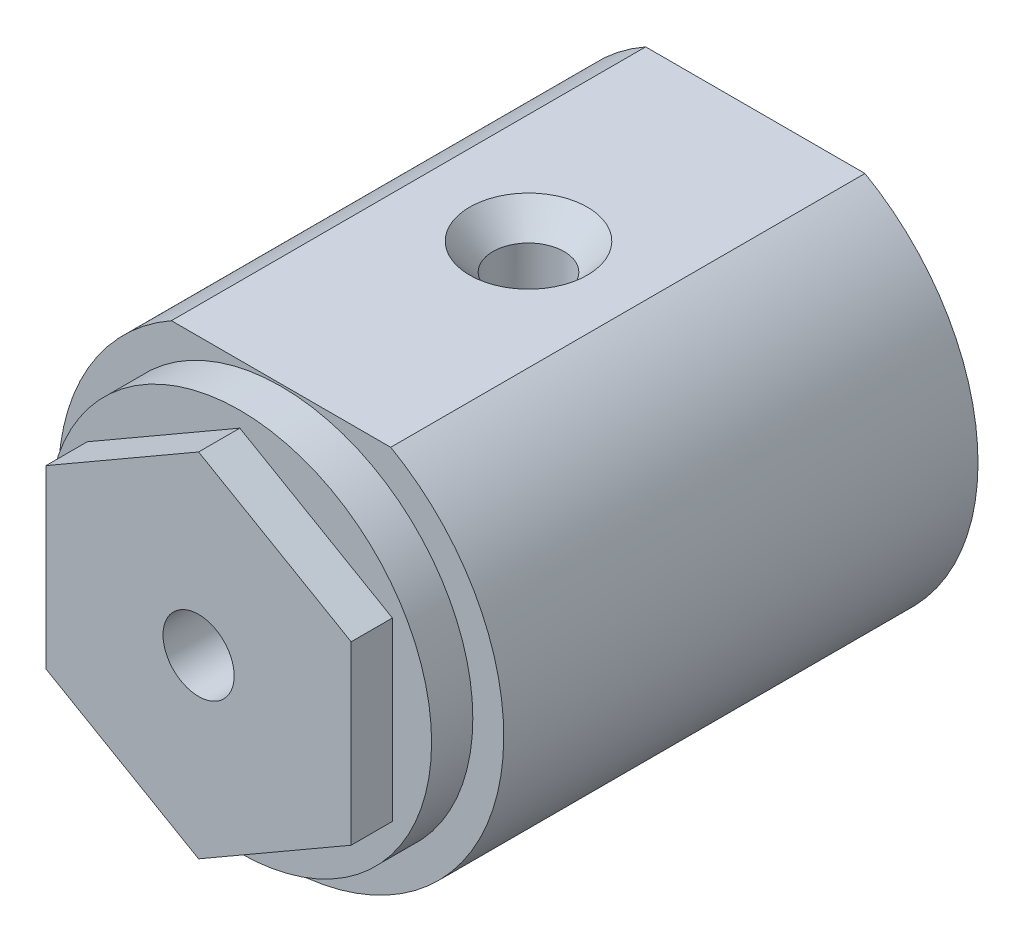
ISO-10303-21;
HEADER;
FILE_DESCRIPTION(('STEP AP214'),'2;1');
FILE_NAME('part.step','',(''),(''),'','','');
FILE_SCHEMA(('AUTOMOTIVE_DESIGN { 1 0 10303 214 1 1 1 1 }'));
ENDSEC;
DATA;
#1=APPLICATION_CONTEXT('core data for automotive mechanical design processes');
#2=APPLICATION_PROTOCOL_DEFINITION('international standard','automotive_design',2000,#1);
#3=PRODUCT_CONTEXT('',#1,'mechanical');
#4=PRODUCT('Part','Part','',(#3));
#5=PRODUCT_RELATED_PRODUCT_CATEGORY('part','',(#4));
#6=PRODUCT_DEFINITION_FORMATION('','',#4);
#7=PRODUCT_DEFINITION_CONTEXT('part definition',#1,'design');
#8=PRODUCT_DEFINITION('design','',#6,#7);
#9=PRODUCT_DEFINITION_SHAPE('','',#8);
#10=(LENGTH_UNIT() NAMED_UNIT(*) SI_UNIT(.MILLI.,.METRE.));
#11=(NAMED_UNIT(*) PLANE_ANGLE_UNIT() SI_UNIT($,.RADIAN.));
#12=(NAMED_UNIT(*) SI_UNIT($,.STERADIAN.) SOLID_ANGLE_UNIT());
#13=UNCERTAINTY_MEASURE_WITH_UNIT(LENGTH_MEASURE(1.E-05),#10,'distance_accuracy_value','');
#14=(GEOMETRIC_REPRESENTATION_CONTEXT(3) GLOBAL_UNCERTAINTY_ASSIGNED_CONTEXT((#13)) GLOBAL_UNIT_ASSIGNED_CONTEXT((#10,
#11,#12)) REPRESENTATION_CONTEXT('',''));
#15=CARTESIAN_POINT('',(0.,0.,0.));
#16=DIRECTION('',(0.,0.,1.));
#17=DIRECTION('',(1.,0.,0.));
#18=AXIS2_PLACEMENT_3D('',#15,#16,#17);
#19=CARTESIAN_POINT('',(0.,0.,25.));
#20=DIRECTION('',(0.,0.,1.));
#21=DIRECTION('',(1.,0.,0.));
#22=AXIS2_PLACEMENT_3D('',#19,#20,#21);
#23=PLANE('',#22);
#24=CARTESIAN_POINT('',(0.,0.,25.));
#25=DIRECTION('',(0.,0.,1.));
#26=DIRECTION('',(1.,0.,0.));
#27=AXIS2_PLACEMENT_3D('',#24,#25,#26);
#28=CIRCLE('',#27,9.3);
#29=CARTESIAN_POINT('',(9.3,0.,25.));
#30=VERTEX_POINT('',#29);
#31=EDGE_CURVE('E244',#30,#30,#28,.T.);
#32=ORIENTED_EDGE('',*,*,#31,.T.);
#33=EDGE_LOOP('',(#32));
#34=FACE_BOUND('',#33,.T.);
#35=DIRECTION('',(-0.866025403784439,-0.5,0.));
#36=VECTOR('',#35,1.);
#37=CARTESIAN_POINT('',(0.,8.54478398400646,25.));
#38=LINE('',#37,#36);
#39=CARTESIAN_POINT('',(0.,8.54478398400646,25.));
#40=VERTEX_POINT('',#39);
#41=CARTESIAN_POINT('',(-7.4,4.27239199200323,25.));
#42=VERTEX_POINT('',#41);
#43=EDGE_CURVE('E221',#40,#42,#38,.T.);
#44=ORIENTED_EDGE('',*,*,#43,.F.);
#45=DIRECTION('',(-0.866025403784439,0.5,0.));
#46=VECTOR('',#45,1.);
#47=CARTESIAN_POINT('',(7.4,4.27239199200323,25.));
#48=LINE('',#47,#46);
#49=CARTESIAN_POINT('',(7.4,4.27239199200323,25.));
#50=VERTEX_POINT('',#49);
#51=EDGE_CURVE('E196',#50,#40,#48,.T.);
#52=ORIENTED_EDGE('',*,*,#51,.F.);
#53=DIRECTION('',(0.,1.,0.));
#54=VECTOR('',#53,1.);
#55=CARTESIAN_POINT('',(7.4,-4.27239199200323,25.));
#56=LINE('',#55,#54);
#57=CARTESIAN_POINT('',(7.4,-4.27239199200323,25.));
#58=VERTEX_POINT('',#57);
#59=EDGE_CURVE('E208',#58,#50,#56,.T.);
#60=ORIENTED_EDGE('',*,*,#59,.F.);
#61=DIRECTION('',(0.866025403784439,0.5,0.));
#62=VECTOR('',#61,1.);
#63=CARTESIAN_POINT('',(0.,-8.54478398400646,25.));
#64=LINE('',#63,#62);
#65=CARTESIAN_POINT('',(0.,-8.54478398400646,25.));
#66=VERTEX_POINT('',#65);
#67=EDGE_CURVE('E227',#66,#58,#64,.T.);
#68=ORIENTED_EDGE('',*,*,#67,.F.);
#69=DIRECTION('',(0.866025403784439,-0.5,0.));
#70=VECTOR('',#69,1.);
#71=CARTESIAN_POINT('',(-7.4,-4.27239199200323,25.));
#72=LINE('',#71,#70);
#73=CARTESIAN_POINT('',(-7.4,-4.27239199200323,25.));
#74=VERTEX_POINT('',#73);
#75=EDGE_CURVE('E225',#74,#66,#72,.T.);
#76=ORIENTED_EDGE('',*,*,#75,.F.);
#77=DIRECTION('',(0.,-1.,0.));
#78=VECTOR('',#77,1.);
#79=CARTESIAN_POINT('',(-7.4,4.27239199200323,25.));
#80=LINE('',#79,#78);
#81=EDGE_CURVE('E223',#42,#74,#80,.T.);
#82=ORIENTED_EDGE('',*,*,#81,.F.);
#83=EDGE_LOOP('',(#44,#52,#60,#68,#76,#82));
#84=FACE_BOUND('',#83,.T.);
#85=ADVANCED_FACE('F32',(#34,#84),#23,.T.);
#86=CARTESIAN_POINT('',(0.,0.,23.));
#87=DIRECTION('',(0.,0.,-1.));
#88=DIRECTION('',(-1.,0.,0.));
#89=AXIS2_PLACEMENT_3D('',#86,#87,#88);
#90=CYLINDRICAL_SURFACE('',#89,7.9);
#91=DIRECTION('',(0.,0.,-1.));
#92=VECTOR('',#91,1.);
#93=CARTESIAN_POINT('',(-5.25357021462548,5.9,23.));
#94=LINE('',#93,#92);
#95=CARTESIAN_POINT('',(-5.25357021462548,5.9,19.));
#96=VERTEX_POINT('',#95);
#97=CARTESIAN_POINT('',(-5.25357021462548,5.9,0.));
#98=VERTEX_POINT('',#97);
#99=EDGE_CURVE('E265',#96,#98,#94,.T.);
#100=ORIENTED_EDGE('',*,*,#99,.F.);
#101=CARTESIAN_POINT('',(0.,0.,19.));
#102=DIRECTION('',(0.,0.,1.));
#103=DIRECTION('',(1.,0.,0.));
#104=AXIS2_PLACEMENT_3D('',#101,#102,#103);
#105=CIRCLE('',#104,7.9);
#106=CARTESIAN_POINT('',(5.25357021462548,5.9,19.));
#107=VERTEX_POINT('',#106);
#108=EDGE_CURVE('E247',#96,#107,#105,.T.);
#109=ORIENTED_EDGE('',*,*,#108,.T.);
#110=DIRECTION('',(0.,0.,-1.));
#111=VECTOR('',#110,1.);
#112=CARTESIAN_POINT('',(5.25357021462548,5.9,23.));
#113=LINE('',#112,#111);
#114=CARTESIAN_POINT('',(5.25357021462548,5.9,0.));
#115=VERTEX_POINT('',#114);
#116=EDGE_CURVE('E267',#107,#115,#113,.T.);
#117=ORIENTED_EDGE('',*,*,#116,.T.);
#118=CARTESIAN_POINT('',(0.,0.,0.));
#119=DIRECTION('',(0.,0.,1.));
#120=DIRECTION('',(1.,0.,0.));
#121=AXIS2_PLACEMENT_3D('',#118,#119,#120);
#122=CIRCLE('',#121,7.9);
#123=EDGE_CURVE('E259',#98,#115,#122,.T.);
#124=ORIENTED_EDGE('',*,*,#123,.F.);
#125=EDGE_LOOP('',(#100,#109,#117,#124));
#126=FACE_BOUND('',#125,.T.);
#127=ADVANCED_FACE('F294',(#126),#90,.F.);
#128=CARTESIAN_POINT('',(-5.25357021462548,5.9,23.));
#129=DIRECTION('',(0.,-1.,0.));
#130=DIRECTION('',(0.,0.,-1.));
#131=AXIS2_PLACEMENT_3D('',#128,#129,#130);
#132=PLANE('',#131);
#133=CARTESIAN_POINT('',(0.,5.9,11.));
#134=DIRECTION('',(0.,-1.,0.));
#135=DIRECTION('',(0.,0.,-1.));
#136=AXIS2_PLACEMENT_3D('',#133,#134,#135);
#137=CIRCLE('',#136,1.7272);
#138=CARTESIAN_POINT('',(0.,5.9,9.2728));
#139=VERTEX_POINT('',#138);
#140=EDGE_CURVE('E256',#139,#139,#137,.T.);
#141=ORIENTED_EDGE('',*,*,#140,.F.);
#142=EDGE_LOOP('',(#141));
#143=FACE_BOUND('',#142,.T.);
#144=ORIENTED_EDGE('',*,*,#116,.F.);
#145=DIRECTION('',(-1.,0.,0.));
#146=VECTOR('',#145,1.);
#147=CARTESIAN_POINT('',(-5.25357021462548,5.9,19.));
#148=LINE('',#147,#146);
#149=EDGE_CURVE('E41',#107,#96,#148,.T.);
#150=ORIENTED_EDGE('',*,*,#149,.T.);
#151=ORIENTED_EDGE('',*,*,#99,.T.);
#152=DIRECTION('',(-1.,0.,0.));
#153=VECTOR('',#152,1.);
#154=CARTESIAN_POINT('',(-5.25357021462548,5.9,0.));
#155=LINE('',#154,#153);
#156=EDGE_CURVE('E262',#115,#98,#155,.T.);
#157=ORIENTED_EDGE('',*,*,#156,.F.);
#158=EDGE_LOOP('',(#144,#150,#151,#157));
#159=FACE_BOUND('',#158,.T.);
#160=ADVANCED_FACE('F289',(#143,#159),#132,.T.);
#161=CARTESIAN_POINT('',(0.,0.,23.));
#162=DIRECTION('',(0.,0.,1.));
#163=DIRECTION('',(1.,0.,0.));
#164=AXIS2_PLACEMENT_3D('',#161,#162,#163);
#165=PLANE('',#164);
#166=CARTESIAN_POINT('',(0.,0.,23.));
#167=DIRECTION('',(0.,0.,1.));
#168=DIRECTION('',(1.,0.,0.));
#169=AXIS2_PLACEMENT_3D('',#166,#167,#168);
#170=CIRCLE('',#169,9.3);
#171=CARTESIAN_POINT('',(9.3,0.,23.));
#172=VERTEX_POINT('',#171);
#173=EDGE_CURVE('E11',#172,#172,#170,.T.);
#174=ORIENTED_EDGE('',*,*,#173,.F.);
#175=EDGE_LOOP('',(#174));
#176=FACE_BOUND('',#175,.T.);
#177=CARTESIAN_POINT('',(0.,0.,23.));
#178=DIRECTION('',(0.,0.,1.));
#179=DIRECTION('',(1.,0.,0.));
#180=AXIS2_PLACEMENT_3D('',#177,#178,#179);
#181=CIRCLE('',#180,10.8);
#182=CARTESIAN_POINT('',(-5.31789432012333,9.4,23.));
#183=VERTEX_POINT('',#182);
#184=CARTESIAN_POINT('',(5.31789432012333,9.4,23.));
#185=VERTEX_POINT('',#184);
#186=EDGE_CURVE('E270',#183,#185,#181,.T.);
#187=ORIENTED_EDGE('',*,*,#186,.T.);
#188=DIRECTION('',(-1.,0.,0.));
#189=VECTOR('',#188,1.);
#190=CARTESIAN_POINT('',(-5.31789432012333,9.4,23.));
#191=LINE('',#190,#189);
#192=EDGE_CURVE('E273',#185,#183,#191,.T.);
#193=ORIENTED_EDGE('',*,*,#192,.T.);
#194=EDGE_LOOP('',(#187,#193));
#195=FACE_BOUND('',#194,.T.);
#196=ADVANCED_FACE('F298',(#176,#195),#165,.T.);
#197=CARTESIAN_POINT('',(0.,0.,0.));
#198=DIRECTION('',(0.,0.,1.));
#199=DIRECTION('',(1.,0.,0.));
#200=AXIS2_PLACEMENT_3D('',#197,#198,#199);
#201=PLANE('',#200);
#202=CARTESIAN_POINT('',(0.,0.,0.));
#203=DIRECTION('',(0.,0.,1.));
#204=DIRECTION('',(1.,0.,0.));
#205=AXIS2_PLACEMENT_3D('',#202,#203,#204);
#206=CIRCLE('',#205,10.8);
#207=CARTESIAN_POINT('',(-5.31789432012333,9.4,0.));
#208=VERTEX_POINT('',#207);
#209=CARTESIAN_POINT('',(5.31789432012333,9.4,0.));
#210=VERTEX_POINT('',#209);
#211=EDGE_CURVE('E269',#208,#210,#206,.T.);
#212=ORIENTED_EDGE('',*,*,#211,.F.);
#213=DIRECTION('',(-1.,0.,0.));
#214=VECTOR('',#213,1.);
#215=CARTESIAN_POINT('',(-5.31789432012333,9.4,0.));
#216=LINE('',#215,#214);
#217=EDGE_CURVE('E274',#210,#208,#216,.T.);
#218=ORIENTED_EDGE('',*,*,#217,.F.);
#219=EDGE_LOOP('',(#212,#218));
#220=FACE_BOUND('',#219,.T.);
#221=ORIENTED_EDGE('',*,*,#123,.T.);
#222=ORIENTED_EDGE('',*,*,#156,.T.);
#223=EDGE_LOOP('',(#221,#222));
#224=FACE_BOUND('',#223,.T.);
#225=ADVANCED_FACE('F296',(#220,#224),#201,.F.);
#226=CARTESIAN_POINT('',(0.,0.,23.));
#227=DIRECTION('',(0.,0.,-1.));
#228=DIRECTION('',(-1.,0.,0.));
#229=AXIS2_PLACEMENT_3D('',#226,#227,#228);
#230=CYLINDRICAL_SURFACE('',#229,10.8);
#231=ORIENTED_EDGE('',*,*,#211,.T.);
#232=DIRECTION('',(0.,0.,-1.));
#233=VECTOR('',#232,1.);
#234=CARTESIAN_POINT('',(5.31789432012333,9.4,23.));
#235=LINE('',#234,#233);
#236=EDGE_CURVE('E282',#185,#210,#235,.T.);
#237=ORIENTED_EDGE('',*,*,#236,.F.);
#238=ORIENTED_EDGE('',*,*,#186,.F.);
#239=DIRECTION('',(0.,0.,-1.));
#240=VECTOR('',#239,1.);
#241=CARTESIAN_POINT('',(-5.31789432012333,9.4,23.));
#242=LINE('',#241,#240);
#243=EDGE_CURVE('E276',#183,#208,#242,.T.);
#244=ORIENTED_EDGE('',*,*,#243,.T.);
#245=EDGE_LOOP('',(#231,#237,#238,#244));
#246=FACE_BOUND('',#245,.T.);
#247=ADVANCED_FACE('F34',(#246),#230,.T.);
#248=CARTESIAN_POINT('',(-5.31789432012333,9.4,23.));
#249=DIRECTION('',(0.,-1.,0.));
#250=DIRECTION('',(0.,0.,-1.));
#251=AXIS2_PLACEMENT_3D('',#248,#249,#250);
#252=PLANE('',#251);
#253=CARTESIAN_POINT('',(0.,9.4,11.));
#254=DIRECTION('',(0.,1.,0.));
#255=DIRECTION('',(0.,0.,1.));
#256=AXIS2_PLACEMENT_3D('',#253,#254,#255);
#257=CIRCLE('',#256,2.8575);
#258=CARTESIAN_POINT('',(0.,9.4,13.8575));
#259=VERTEX_POINT('',#258);
#260=EDGE_CURVE('E250',#259,#259,#257,.T.);
#261=ORIENTED_EDGE('',*,*,#260,.F.);
#262=EDGE_LOOP('',(#261));
#263=FACE_BOUND('',#262,.T.);
#264=ORIENTED_EDGE('',*,*,#217,.T.);
#265=ORIENTED_EDGE('',*,*,#243,.F.);
#266=ORIENTED_EDGE('',*,*,#192,.F.);
#267=ORIENTED_EDGE('',*,*,#236,.T.);
#268=EDGE_LOOP('',(#264,#265,#266,#267));
#269=FACE_BOUND('',#268,.T.);
#270=ADVANCED_FACE('F305',(#263,#269),#252,.F.);
#271=CARTESIAN_POINT('',(0.,9.4,11.));
#272=DIRECTION('',(0.,1.,0.));
#273=DIRECTION('',(0.,0.,1.));
#274=AXIS2_PLACEMENT_3D('',#271,#272,#273);
#275=CYLINDRICAL_SURFACE('',#274,1.7272);
#276=CARTESIAN_POINT('',(0.,8.0997385893181,11.));
#277=DIRECTION('',(0.,1.,0.));
#278=DIRECTION('',(0.,0.,1.));
#279=AXIS2_PLACEMENT_3D('',#276,#277,#278);
#280=CIRCLE('',#279,1.7272);
#281=CARTESIAN_POINT('',(0.,8.0997385893181,12.7272));
#282=VERTEX_POINT('',#281);
#283=EDGE_CURVE('E253',#282,#282,#280,.T.);
#284=ORIENTED_EDGE('',*,*,#283,.T.);
#285=EDGE_LOOP('',(#284));
#286=FACE_BOUND('',#285,.T.);
#287=ORIENTED_EDGE('',*,*,#140,.T.);
#288=EDGE_LOOP('',(#287));
#289=FACE_BOUND('',#288,.T.);
#290=ADVANCED_FACE('F333',(#286,#289),#275,.F.);
#291=CARTESIAN_POINT('',(0.,9.4,11.));
#292=DIRECTION('',(0.,1.,0.));
#293=DIRECTION('',(0.,0.,1.));
#294=AXIS2_PLACEMENT_3D('',#291,#292,#293);
#295=CONICAL_SURFACE('',#294,2.8575,0.715584993317676);
#296=ORIENTED_EDGE('',*,*,#283,.F.);
#297=EDGE_LOOP('',(#296));
#298=FACE_BOUND('',#297,.T.);
#299=ORIENTED_EDGE('',*,*,#260,.T.);
#300=EDGE_LOOP('',(#299));
#301=FACE_BOUND('',#300,.T.);
#302=ADVANCED_FACE('F326',(#298,#301),#295,.F.);
#303=CARTESIAN_POINT('',(0.,0.,19.));
#304=DIRECTION('',(0.,0.,1.));
#305=DIRECTION('',(1.,0.,0.));
#306=AXIS2_PLACEMENT_3D('',#303,#304,#305);
#307=PLANE('',#306);
#308=DIRECTION('',(0.866025403784439,-0.5,0.));
#309=VECTOR('',#308,1.);
#310=CARTESIAN_POINT('',(0.,3.86824680357049,19.));
#311=LINE('',#310,#309);
#312=CARTESIAN_POINT('',(0.,3.86824680357049,19.));
#313=VERTEX_POINT('',#312);
#314=CARTESIAN_POINT('',(3.35,1.93412340178525,19.));
#315=VERTEX_POINT('',#314);
#316=EDGE_CURVE('E184',#313,#315,#311,.T.);
#317=ORIENTED_EDGE('',*,*,#316,.F.);
#318=DIRECTION('',(0.866025403784439,0.5,0.));
#319=VECTOR('',#318,1.);
#320=CARTESIAN_POINT('',(-3.35,1.93412340178525,19.));
#321=LINE('',#320,#319);
#322=CARTESIAN_POINT('',(-3.35,1.93412340178525,19.));
#323=VERTEX_POINT('',#322);
#324=EDGE_CURVE('E48',#323,#313,#321,.T.);
#325=ORIENTED_EDGE('',*,*,#324,.F.);
#326=DIRECTION('',(0.,1.,0.));
#327=VECTOR('',#326,1.);
#328=CARTESIAN_POINT('',(-3.35,-1.93412340178525,19.));
#329=LINE('',#328,#327);
#330=CARTESIAN_POINT('',(-3.35,-1.93412340178525,19.));
#331=VERTEX_POINT('',#330);
#332=EDGE_CURVE('E168',#331,#323,#329,.T.);
#333=ORIENTED_EDGE('',*,*,#332,.F.);
#334=DIRECTION('',(-0.866025403784439,0.5,0.));
#335=VECTOR('',#334,1.);
#336=CARTESIAN_POINT('',(0.,-3.86824680357049,19.));
#337=LINE('',#336,#335);
#338=CARTESIAN_POINT('',(0.,-3.86824680357049,19.));
#339=VERTEX_POINT('',#338);
#340=EDGE_CURVE('E171',#339,#331,#337,.T.);
#341=ORIENTED_EDGE('',*,*,#340,.F.);
#342=DIRECTION('',(-0.866025403784439,-0.5,0.));
#343=VECTOR('',#342,1.);
#344=CARTESIAN_POINT('',(3.35,-1.93412340178525,19.));
#345=LINE('',#344,#343);
#346=CARTESIAN_POINT('',(3.35,-1.93412340178525,19.));
#347=VERTEX_POINT('',#346);
#348=EDGE_CURVE('E189',#347,#339,#345,.T.);
#349=ORIENTED_EDGE('',*,*,#348,.F.);
#350=DIRECTION('',(0.,-1.,0.));
#351=VECTOR('',#350,1.);
#352=CARTESIAN_POINT('',(3.35,1.93412340178525,19.));
#353=LINE('',#352,#351);
#354=EDGE_CURVE('E186',#315,#347,#353,.T.);
#355=ORIENTED_EDGE('',*,*,#354,.F.);
#356=EDGE_LOOP('',(#317,#325,#333,#341,#349,#355));
#357=FACE_BOUND('',#356,.T.);
#358=ORIENTED_EDGE('',*,*,#108,.F.);
#359=ORIENTED_EDGE('',*,*,#149,.F.);
#360=EDGE_LOOP('',(#358,#359));
#361=FACE_BOUND('',#360,.T.);
#362=ADVANCED_FACE('F322',(#357,#361),#307,.F.);
#363=CARTESIAN_POINT('',(0.,0.,19.));
#364=DIRECTION('',(0.,0.,1.));
#365=DIRECTION('',(1.,0.,0.));
#366=AXIS2_PLACEMENT_3D('',#363,#364,#365);
#367=CYLINDRICAL_SURFACE('',#366,9.3);
#368=ORIENTED_EDGE('',*,*,#173,.T.);
#369=EDGE_LOOP('',(#368));
#370=FACE_BOUND('',#369,.T.);
#371=ORIENTED_EDGE('',*,*,#31,.F.);
#372=EDGE_LOOP('',(#371));
#373=FACE_BOUND('',#372,.T.);
#374=ADVANCED_FACE('F325',(#370,#373),#367,.T.);
#375=CARTESIAN_POINT('',(7.4,4.27239199200323,27.));
#376=DIRECTION('',(-0.5,-0.866025403784439,0.));
#377=DIRECTION('',(0.866025403784439,-0.5,0.));
#378=AXIS2_PLACEMENT_3D('',#375,#376,#377);
#379=PLANE('',#378);
#380=ORIENTED_EDGE('',*,*,#51,.T.);
#381=DIRECTION('',(0.,0.,-1.));
#382=VECTOR('',#381,1.);
#383=CARTESIAN_POINT('',(0.,8.54478398400646,27.));
#384=LINE('',#383,#382);
#385=CARTESIAN_POINT('',(0.,8.54478398400646,27.));
#386=VERTEX_POINT('',#385);
#387=EDGE_CURVE('E242',#386,#40,#384,.T.);
#388=ORIENTED_EDGE('',*,*,#387,.F.);
#389=DIRECTION('',(-0.866025403784439,0.5,0.));
#390=VECTOR('',#389,1.);
#391=CARTESIAN_POINT('',(7.4,4.27239199200323,27.));
#392=LINE('',#391,#390);
#393=CARTESIAN_POINT('',(7.4,4.27239199200323,27.));
#394=VERTEX_POINT('',#393);
#395=EDGE_CURVE('E204',#394,#386,#392,.T.);
#396=ORIENTED_EDGE('',*,*,#395,.F.);
#397=DIRECTION('',(0.,0.,-1.));
#398=VECTOR('',#397,1.);
#399=CARTESIAN_POINT('',(7.4,4.27239199200323,27.));
#400=LINE('',#399,#398);
#401=EDGE_CURVE('E218',#394,#50,#400,.T.);
#402=ORIENTED_EDGE('',*,*,#401,.T.);
#403=EDGE_LOOP('',(#380,#388,#396,#402));
#404=FACE_BOUND('',#403,.T.);
#405=ADVANCED_FACE('F320',(#404),#379,.F.);
#406=CARTESIAN_POINT('',(0.,8.54478398400646,27.));
#407=DIRECTION('',(0.5,-0.866025403784439,0.));
#408=DIRECTION('',(0.866025403784439,0.5,0.));
#409=AXIS2_PLACEMENT_3D('',#406,#407,#408);
#410=PLANE('',#409);
#411=ORIENTED_EDGE('',*,*,#43,.T.);
#412=DIRECTION('',(0.,0.,-1.));
#413=VECTOR('',#412,1.);
#414=CARTESIAN_POINT('',(-7.4,4.27239199200323,27.));
#415=LINE('',#414,#413);
#416=CARTESIAN_POINT('',(-7.4,4.27239199200323,27.));
#417=VERTEX_POINT('',#416);
#418=EDGE_CURVE('E239',#417,#42,#415,.T.);
#419=ORIENTED_EDGE('',*,*,#418,.F.);
#420=DIRECTION('',(-0.866025403784439,-0.5,0.));
#421=VECTOR('',#420,1.);
#422=CARTESIAN_POINT('',(0.,8.54478398400646,27.));
#423=LINE('',#422,#421);
#424=EDGE_CURVE('E207',#386,#417,#423,.T.);
#425=ORIENTED_EDGE('',*,*,#424,.F.);
#426=ORIENTED_EDGE('',*,*,#387,.T.);
#427=EDGE_LOOP('',(#411,#419,#425,#426));
#428=FACE_BOUND('',#427,.T.);
#429=ADVANCED_FACE('F371',(#428),#410,.F.);
#430=CARTESIAN_POINT('',(-7.4,4.27239199200323,27.));
#431=DIRECTION('',(1.,0.,0.));
#432=DIRECTION('',(0.,1.,0.));
#433=AXIS2_PLACEMENT_3D('',#430,#431,#432);
#434=PLANE('',#433);
#435=ORIENTED_EDGE('',*,*,#81,.T.);
#436=DIRECTION('',(0.,0.,-1.));
#437=VECTOR('',#436,1.);
#438=CARTESIAN_POINT('',(-7.4,-4.27239199200323,27.));
#439=LINE('',#438,#437);
#440=CARTESIAN_POINT('',(-7.4,-4.27239199200323,27.));
#441=VERTEX_POINT('',#440);
#442=EDGE_CURVE('E236',#441,#74,#439,.T.);
#443=ORIENTED_EDGE('',*,*,#442,.F.);
#444=DIRECTION('',(0.,-1.,0.));
#445=VECTOR('',#444,1.);
#446=CARTESIAN_POINT('',(-7.4,4.27239199200323,27.));
#447=LINE('',#446,#445);
#448=EDGE_CURVE('E210',#417,#441,#447,.T.);
#449=ORIENTED_EDGE('',*,*,#448,.F.);
#450=ORIENTED_EDGE('',*,*,#418,.T.);
#451=EDGE_LOOP('',(#435,#443,#449,#450));
#452=FACE_BOUND('',#451,.T.);
#453=ADVANCED_FACE('F380',(#452),#434,.F.);
#454=CARTESIAN_POINT('',(-7.4,-4.27239199200323,27.));
#455=DIRECTION('',(0.5,0.866025403784439,0.));
#456=DIRECTION('',(-0.866025403784439,0.5,0.));
#457=AXIS2_PLACEMENT_3D('',#454,#455,#456);
#458=PLANE('',#457);
#459=ORIENTED_EDGE('',*,*,#75,.T.);
#460=DIRECTION('',(0.,0.,-1.));
#461=VECTOR('',#460,1.);
#462=CARTESIAN_POINT('',(0.,-8.54478398400646,27.));
#463=LINE('',#462,#461);
#464=CARTESIAN_POINT('',(0.,-8.54478398400646,27.));
#465=VERTEX_POINT('',#464);
#466=EDGE_CURVE('E233',#465,#66,#463,.T.);
#467=ORIENTED_EDGE('',*,*,#466,.F.);
#468=DIRECTION('',(0.866025403784439,-0.5,0.));
#469=VECTOR('',#468,1.);
#470=CARTESIAN_POINT('',(-7.4,-4.27239199200323,27.));
#471=LINE('',#470,#469);
#472=EDGE_CURVE('E212',#441,#465,#471,.T.);
#473=ORIENTED_EDGE('',*,*,#472,.F.);
#474=ORIENTED_EDGE('',*,*,#442,.T.);
#475=EDGE_LOOP('',(#459,#467,#473,#474));
#476=FACE_BOUND('',#475,.T.);
#477=ADVANCED_FACE('F389',(#476),#458,.F.);
#478=CARTESIAN_POINT('',(0.,-8.54478398400646,27.));
#479=DIRECTION('',(-0.5,0.866025403784439,0.));
#480=DIRECTION('',(-0.866025403784439,-0.5,0.));
#481=AXIS2_PLACEMENT_3D('',#478,#479,#480);
#482=PLANE('',#481);
#483=ORIENTED_EDGE('',*,*,#67,.T.);
#484=DIRECTION('',(0.,0.,-1.));
#485=VECTOR('',#484,1.);
#486=CARTESIAN_POINT('',(7.4,-4.27239199200323,27.));
#487=LINE('',#486,#485);
#488=CARTESIAN_POINT('',(7.4,-4.27239199200323,27.));
#489=VERTEX_POINT('',#488);
#490=EDGE_CURVE('E56',#489,#58,#487,.T.);
#491=ORIENTED_EDGE('',*,*,#490,.F.);
#492=DIRECTION('',(0.866025403784439,0.5,0.));
#493=VECTOR('',#492,1.);
#494=CARTESIAN_POINT('',(0.,-8.54478398400646,27.));
#495=LINE('',#494,#493);
#496=EDGE_CURVE('E214',#465,#489,#495,.T.);
#497=ORIENTED_EDGE('',*,*,#496,.F.);
#498=ORIENTED_EDGE('',*,*,#466,.T.);
#499=EDGE_LOOP('',(#483,#491,#497,#498));
#500=FACE_BOUND('',#499,.T.);
#501=ADVANCED_FACE('F399',(#500),#482,.F.);
#502=CARTESIAN_POINT('',(7.4,-4.27239199200323,27.));
#503=DIRECTION('',(-1.,0.,0.));
#504=DIRECTION('',(0.,-1.,0.));
#505=AXIS2_PLACEMENT_3D('',#502,#503,#504);
#506=PLANE('',#505);
#507=ORIENTED_EDGE('',*,*,#59,.T.);
#508=ORIENTED_EDGE('',*,*,#401,.F.);
#509=DIRECTION('',(0.,1.,0.));
#510=VECTOR('',#509,1.);
#511=CARTESIAN_POINT('',(7.4,-4.27239199200323,27.));
#512=LINE('',#511,#510);
#513=EDGE_CURVE('E216',#489,#394,#512,.T.);
#514=ORIENTED_EDGE('',*,*,#513,.F.);
#515=ORIENTED_EDGE('',*,*,#490,.T.);
#516=EDGE_LOOP('',(#507,#508,#514,#515));
#517=FACE_BOUND('',#516,.T.);
#518=ADVANCED_FACE('F409',(#517),#506,.F.);
#519=CARTESIAN_POINT('',(0.,0.,27.));
#520=DIRECTION('',(0.,0.,1.));
#521=DIRECTION('',(1.,0.,0.));
#522=AXIS2_PLACEMENT_3D('',#519,#520,#521);
#523=PLANE('',#522);
#524=CARTESIAN_POINT('',(0.,0.,27.));
#525=DIRECTION('',(0.,0.,-1.));
#526=DIRECTION('',(-1.,0.,0.));
#527=AXIS2_PLACEMENT_3D('',#524,#525,#526);
#528=CIRCLE('',#527,1.725);
#529=CARTESIAN_POINT('',(-1.725,0.,27.));
#530=VERTEX_POINT('',#529);
#531=EDGE_CURVE('E174',#530,#530,#528,.T.);
#532=ORIENTED_EDGE('',*,*,#531,.T.);
#533=EDGE_LOOP('',(#532));
#534=FACE_BOUND('',#533,.T.);
#535=ORIENTED_EDGE('',*,*,#395,.T.);
#536=ORIENTED_EDGE('',*,*,#424,.T.);
#537=ORIENTED_EDGE('',*,*,#448,.T.);
#538=ORIENTED_EDGE('',*,*,#472,.T.);
#539=ORIENTED_EDGE('',*,*,#496,.T.);
#540=ORIENTED_EDGE('',*,*,#513,.T.);
#541=EDGE_LOOP('',(#535,#536,#537,#538,#539,#540));
#542=FACE_BOUND('',#541,.T.);
#543=ADVANCED_FACE('F419',(#534,#542),#523,.T.);
#544=CARTESIAN_POINT('',(-3.35,1.93412340178525,22.6));
#545=DIRECTION('',(-0.5,0.866025403784439,0.));
#546=DIRECTION('',(-0.866025403784439,-0.5,0.));
#547=AXIS2_PLACEMENT_3D('',#544,#545,#546);
#548=PLANE('',#547);
#549=ORIENTED_EDGE('',*,*,#324,.T.);
#550=DIRECTION('',(0.,0.,-1.));
#551=VECTOR('',#550,1.);
#552=CARTESIAN_POINT('',(0.,3.86824680357049,22.6));
#553=LINE('',#552,#551);
#554=CARTESIAN_POINT('',(0.,3.86824680357049,22.6));
#555=VERTEX_POINT('',#554);
#556=EDGE_CURVE('E145',#555,#313,#553,.T.);
#557=ORIENTED_EDGE('',*,*,#556,.F.);
#558=DIRECTION('',(0.866025403784439,0.5,0.));
#559=VECTOR('',#558,1.);
#560=CARTESIAN_POINT('',(-3.35,1.93412340178525,22.6));
#561=LINE('',#560,#559);
#562=CARTESIAN_POINT('',(-3.35,1.93412340178525,22.6));
#563=VERTEX_POINT('',#562);
#564=EDGE_CURVE('E149',#563,#555,#561,.T.);
#565=ORIENTED_EDGE('',*,*,#564,.F.);
#566=DIRECTION('',(0.,0.,-1.));
#567=VECTOR('',#566,1.);
#568=CARTESIAN_POINT('',(-3.35,1.93412340178525,22.6));
#569=LINE('',#568,#567);
#570=EDGE_CURVE('E194',#563,#323,#569,.T.);
#571=ORIENTED_EDGE('',*,*,#570,.T.);
#572=EDGE_LOOP('',(#549,#557,#565,#571));
#573=FACE_BOUND('',#572,.T.);
#574=ADVANCED_FACE('F147',(#573),#548,.F.);
#575=CARTESIAN_POINT('',(-3.35,-1.93412340178525,22.6));
#576=DIRECTION('',(-1.,0.,0.));
#577=DIRECTION('',(0.,-1.,0.));
#578=AXIS2_PLACEMENT_3D('',#575,#576,#577);
#579=PLANE('',#578);
#580=ORIENTED_EDGE('',*,*,#332,.T.);
#581=ORIENTED_EDGE('',*,*,#570,.F.);
#582=DIRECTION('',(0.,1.,0.));
#583=VECTOR('',#582,1.);
#584=CARTESIAN_POINT('',(-3.35,-1.93412340178525,22.6));
#585=LINE('',#584,#583);
#586=CARTESIAN_POINT('',(-3.35,-1.93412340178525,22.6));
#587=VERTEX_POINT('',#586);
#588=EDGE_CURVE('E155',#587,#563,#585,.T.);
#589=ORIENTED_EDGE('',*,*,#588,.F.);
#590=DIRECTION('',(0.,0.,-1.));
#591=VECTOR('',#590,1.);
#592=CARTESIAN_POINT('',(-3.35,-1.93412340178525,22.6));
#593=LINE('',#592,#591);
#594=EDGE_CURVE('E197',#587,#331,#593,.T.);
#595=ORIENTED_EDGE('',*,*,#594,.T.);
#596=EDGE_LOOP('',(#580,#581,#589,#595));
#597=FACE_BOUND('',#596,.T.);
#598=ADVANCED_FACE('F436',(#597),#579,.F.);
#599=CARTESIAN_POINT('',(0.,-3.86824680357049,22.6));
#600=DIRECTION('',(-0.5,-0.866025403784439,0.));
#601=DIRECTION('',(0.866025403784439,-0.5,0.));
#602=AXIS2_PLACEMENT_3D('',#599,#600,#601);
#603=PLANE('',#602);
#604=ORIENTED_EDGE('',*,*,#340,.T.);
#605=ORIENTED_EDGE('',*,*,#594,.F.);
#606=DIRECTION('',(-0.866025403784439,0.5,0.));
#607=VECTOR('',#606,1.);
#608=CARTESIAN_POINT('',(0.,-3.86824680357049,22.6));
#609=LINE('',#608,#607);
#610=CARTESIAN_POINT('',(0.,-3.86824680357049,22.6));
#611=VERTEX_POINT('',#610);
#612=EDGE_CURVE('E180',#611,#587,#609,.T.);
#613=ORIENTED_EDGE('',*,*,#612,.F.);
#614=DIRECTION('',(0.,0.,-1.));
#615=VECTOR('',#614,1.);
#616=CARTESIAN_POINT('',(0.,-3.86824680357049,22.6));
#617=LINE('',#616,#615);
#618=EDGE_CURVE('E199',#611,#339,#617,.T.);
#619=ORIENTED_EDGE('',*,*,#618,.T.);
#620=EDGE_LOOP('',(#604,#605,#613,#619));
#621=FACE_BOUND('',#620,.T.);
#622=ADVANCED_FACE('F445',(#621),#603,.F.);
#623=CARTESIAN_POINT('',(3.35,-1.93412340178525,22.6));
#624=DIRECTION('',(0.5,-0.866025403784439,0.));
#625=DIRECTION('',(0.866025403784439,0.5,0.));
#626=AXIS2_PLACEMENT_3D('',#623,#624,#625);
#627=PLANE('',#626);
#628=ORIENTED_EDGE('',*,*,#348,.T.);
#629=ORIENTED_EDGE('',*,*,#618,.F.);
#630=DIRECTION('',(-0.866025403784439,-0.5,0.));
#631=VECTOR('',#630,1.);
#632=CARTESIAN_POINT('',(3.35,-1.93412340178525,22.6));
#633=LINE('',#632,#631);
#634=CARTESIAN_POINT('',(3.35,-1.93412340178525,22.6));
#635=VERTEX_POINT('',#634);
#636=EDGE_CURVE('E177',#635,#611,#633,.T.);
#637=ORIENTED_EDGE('',*,*,#636,.F.);
#638=DIRECTION('',(0.,0.,-1.));
#639=VECTOR('',#638,1.);
#640=CARTESIAN_POINT('',(3.35,-1.93412340178525,22.6));
#641=LINE('',#640,#639);
#642=EDGE_CURVE('E201',#635,#347,#641,.T.);
#643=ORIENTED_EDGE('',*,*,#642,.T.);
#644=EDGE_LOOP('',(#628,#629,#637,#643));
#645=FACE_BOUND('',#644,.T.);
#646=ADVANCED_FACE('F455',(#645),#627,.F.);
#647=CARTESIAN_POINT('',(3.35,1.93412340178525,22.6));
#648=DIRECTION('',(1.,0.,0.));
#649=DIRECTION('',(0.,1.,0.));
#650=AXIS2_PLACEMENT_3D('',#647,#648,#649);
#651=PLANE('',#650);
#652=ORIENTED_EDGE('',*,*,#354,.T.);
#653=ORIENTED_EDGE('',*,*,#642,.F.);
#654=DIRECTION('',(0.,-1.,0.));
#655=VECTOR('',#654,1.);
#656=CARTESIAN_POINT('',(3.35,1.93412340178525,22.6));
#657=LINE('',#656,#655);
#658=CARTESIAN_POINT('',(3.35,1.93412340178525,22.6));
#659=VERTEX_POINT('',#658);
#660=EDGE_CURVE('E163',#659,#635,#657,.T.);
#661=ORIENTED_EDGE('',*,*,#660,.F.);
#662=DIRECTION('',(0.,0.,-1.));
#663=VECTOR('',#662,1.);
#664=CARTESIAN_POINT('',(3.35,1.93412340178525,22.6));
#665=LINE('',#664,#663);
#666=EDGE_CURVE('E154',#659,#315,#665,.T.);
#667=ORIENTED_EDGE('',*,*,#666,.T.);
#668=EDGE_LOOP('',(#652,#653,#661,#667));
#669=FACE_BOUND('',#668,.T.);
#670=ADVANCED_FACE('F465',(#669),#651,.F.);
#671=CARTESIAN_POINT('',(0.,3.86824680357049,22.6));
#672=DIRECTION('',(0.5,0.866025403784438,0.));
#673=DIRECTION('',(-0.866025403784439,0.5,0.));
#674=AXIS2_PLACEMENT_3D('',#671,#672,#673);
#675=PLANE('',#674);
#676=ORIENTED_EDGE('',*,*,#316,.T.);
#677=ORIENTED_EDGE('',*,*,#666,.F.);
#678=DIRECTION('',(0.866025403784439,-0.5,0.));
#679=VECTOR('',#678,1.);
#680=CARTESIAN_POINT('',(0.,3.86824680357049,22.6));
#681=LINE('',#680,#679);
#682=EDGE_CURVE('E158',#555,#659,#681,.T.);
#683=ORIENTED_EDGE('',*,*,#682,.F.);
#684=ORIENTED_EDGE('',*,*,#556,.T.);
#685=EDGE_LOOP('',(#676,#677,#683,#684));
#686=FACE_BOUND('',#685,.T.);
#687=ADVANCED_FACE('F159',(#686),#675,.F.);
#688=CARTESIAN_POINT('',(0.,0.,22.6));
#689=DIRECTION('',(0.,0.,-1.));
#690=DIRECTION('',(-1.,0.,0.));
#691=AXIS2_PLACEMENT_3D('',#688,#689,#690);
#692=PLANE('',#691);
#693=CARTESIAN_POINT('',(0.,0.,22.6));
#694=DIRECTION('',(0.,0.,-1.));
#695=DIRECTION('',(-1.,0.,0.));
#696=AXIS2_PLACEMENT_3D('',#693,#694,#695);
#697=CIRCLE('',#696,1.725);
#698=CARTESIAN_POINT('',(-1.725,0.,22.6));
#699=VERTEX_POINT('',#698);
#700=EDGE_CURVE('E36',#699,#699,#697,.T.);
#701=ORIENTED_EDGE('',*,*,#700,.F.);
#702=EDGE_LOOP('',(#701));
#703=FACE_BOUND('',#702,.T.);
#704=ORIENTED_EDGE('',*,*,#564,.T.);
#705=ORIENTED_EDGE('',*,*,#682,.T.);
#706=ORIENTED_EDGE('',*,*,#660,.T.);
#707=ORIENTED_EDGE('',*,*,#636,.T.);
#708=ORIENTED_EDGE('',*,*,#612,.T.);
#709=ORIENTED_EDGE('',*,*,#588,.T.);
#710=EDGE_LOOP('',(#704,#705,#706,#707,#708,#709));
#711=FACE_BOUND('',#710,.T.);
#712=ADVANCED_FACE('F165',(#703,#711),#692,.T.);
#713=CARTESIAN_POINT('',(0.,0.,27.));
#714=DIRECTION('',(0.,0.,-1.));
#715=DIRECTION('',(-1.,0.,0.));
#716=AXIS2_PLACEMENT_3D('',#713,#714,#715);
#717=CYLINDRICAL_SURFACE('',#716,1.725);
#718=ORIENTED_EDGE('',*,*,#700,.T.);
#719=EDGE_LOOP('',(#718));
#720=FACE_BOUND('',#719,.T.);
#721=ORIENTED_EDGE('',*,*,#531,.F.);
#722=EDGE_LOOP('',(#721));
#723=FACE_BOUND('',#722,.T.);
#724=ADVANCED_FACE('F499',(#720,#723),#717,.F.);
#725=CLOSED_SHELL('',(#85,#127,#160,#196,#225,#247,#270,#290,#302,#362,#374,#405,#429,#453,#477,
#501,#518,#543,#574,#598,#622,#646,#670,#687,#712,#724));
#726=MANIFOLD_SOLID_BREP('B2',#725);
#727=ADVANCED_BREP_SHAPE_REPRESENTATION('',(#18,#726),#14);
#728=SHAPE_DEFINITION_REPRESENTATION(#9,#727);
ENDSEC;
END-ISO-10303-21;
